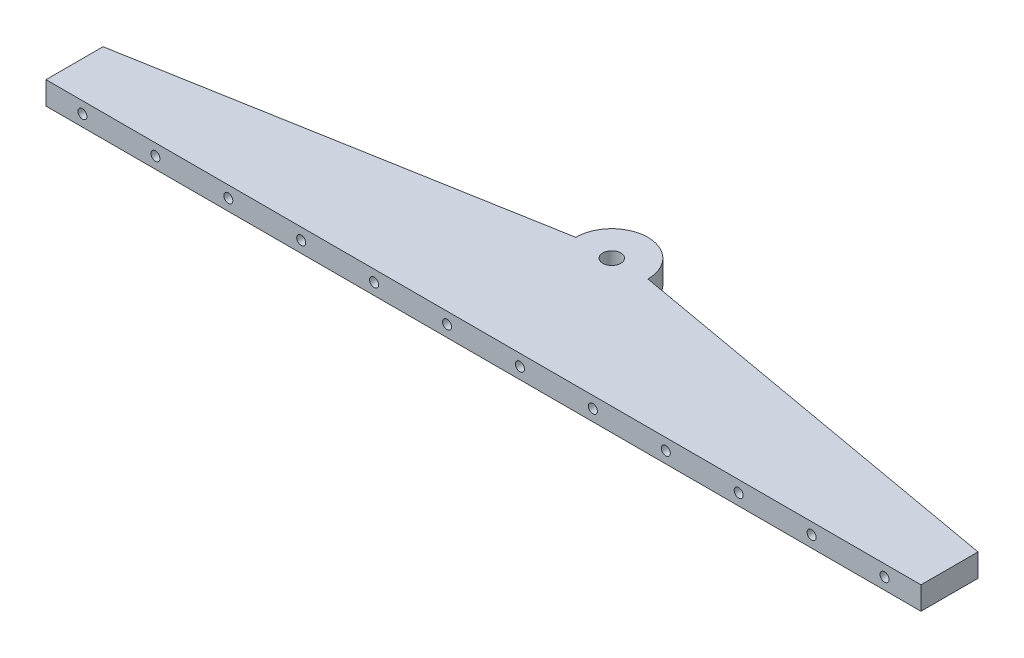
ISO-10303-21;
HEADER;
FILE_DESCRIPTION(('STEP AP214'),'2;1');
FILE_NAME('part.step','',(''),(''),'','','');
FILE_SCHEMA(('AUTOMOTIVE_DESIGN { 1 0 10303 214 1 1 1 1 }'));
ENDSEC;
DATA;
#1=APPLICATION_CONTEXT('core data for automotive mechanical design processes');
#2=APPLICATION_PROTOCOL_DEFINITION('international standard','automotive_design',2000,#1);
#3=PRODUCT_CONTEXT('',#1,'mechanical');
#4=PRODUCT('Part','Part','',(#3));
#5=PRODUCT_RELATED_PRODUCT_CATEGORY('part','',(#4));
#6=PRODUCT_DEFINITION_FORMATION('','',#4);
#7=PRODUCT_DEFINITION_CONTEXT('part definition',#1,'design');
#8=PRODUCT_DEFINITION('design','',#6,#7);
#9=PRODUCT_DEFINITION_SHAPE('','',#8);
#10=(LENGTH_UNIT() NAMED_UNIT(*) SI_UNIT(.MILLI.,.METRE.));
#11=(NAMED_UNIT(*) PLANE_ANGLE_UNIT() SI_UNIT($,.RADIAN.));
#12=(NAMED_UNIT(*) SI_UNIT($,.STERADIAN.) SOLID_ANGLE_UNIT());
#13=UNCERTAINTY_MEASURE_WITH_UNIT(LENGTH_MEASURE(1.E-05),#10,'distance_accuracy_value','');
#14=(GEOMETRIC_REPRESENTATION_CONTEXT(3) GLOBAL_UNCERTAINTY_ASSIGNED_CONTEXT((#13)) GLOBAL_UNIT_ASSIGNED_CONTEXT((#10,
#11,#12)) REPRESENTATION_CONTEXT('',''));
#15=CARTESIAN_POINT('',(0.,0.,0.));
#16=DIRECTION('',(0.,0.,1.));
#17=DIRECTION('',(1.,0.,0.));
#18=AXIS2_PLACEMENT_3D('',#15,#16,#17);
#19=CARTESIAN_POINT('',(0.,6.35,0.));
#20=DIRECTION('',(1.,0.,0.));
#21=DIRECTION('',(0.,0.,-1.));
#22=AXIS2_PLACEMENT_3D('',#19,#20,#21);
#23=PLANE('',#22);
#24=DIRECTION('',(0.,1.,0.));
#25=VECTOR('',#24,1.);
#26=CARTESIAN_POINT('',(0.,-3.65,-15.7961222393426));
#27=LINE('',#26,#25);
#28=CARTESIAN_POINT('',(0.,0.,-15.7961222393426));
#29=VERTEX_POINT('',#28);
#30=CARTESIAN_POINT('',(0.,6.35,-15.7961222393426));
#31=VERTEX_POINT('',#30);
#32=EDGE_CURVE('E126',#29,#31,#27,.T.);
#33=ORIENTED_EDGE('',*,*,#32,.F.);
#34=DIRECTION('',(0.,0.,1.));
#35=VECTOR('',#34,1.);
#36=CARTESIAN_POINT('',(0.,0.,0.));
#37=LINE('',#36,#35);
#38=CARTESIAN_POINT('',(0.,0.,0.));
#39=VERTEX_POINT('',#38);
#40=EDGE_CURVE('E85',#29,#39,#37,.T.);
#41=ORIENTED_EDGE('',*,*,#40,.T.);
#42=DIRECTION('',(0.,-1.,0.));
#43=VECTOR('',#42,1.);
#44=CARTESIAN_POINT('',(0.,6.35,0.));
#45=LINE('',#44,#43);
#46=CARTESIAN_POINT('',(0.,6.35,0.));
#47=VERTEX_POINT('',#46);
#48=EDGE_CURVE('E80',#47,#39,#45,.T.);
#49=ORIENTED_EDGE('',*,*,#48,.F.);
#50=DIRECTION('',(0.,0.,1.));
#51=VECTOR('',#50,1.);
#52=CARTESIAN_POINT('',(0.,6.35,0.));
#53=LINE('',#52,#51);
#54=EDGE_CURVE('E95',#31,#47,#53,.T.);
#55=ORIENTED_EDGE('',*,*,#54,.F.);
#56=EDGE_LOOP('',(#33,#41,#49,#55));
#57=FACE_BOUND('',#56,.T.);
#58=ADVANCED_FACE('F38',(#57),#23,.F.);
#59=CARTESIAN_POINT('',(242.4,6.35,0.));
#60=DIRECTION('',(-1.,0.,0.));
#61=DIRECTION('',(0.,0.,1.));
#62=AXIS2_PLACEMENT_3D('',#59,#60,#61);
#63=PLANE('',#62);
#64=DIRECTION('',(0.,1.,0.));
#65=VECTOR('',#64,1.);
#66=CARTESIAN_POINT('',(242.4,-3.65,-15.7961222393426));
#67=LINE('',#66,#65);
#68=CARTESIAN_POINT('',(242.4,0.,-15.7961222393426));
#69=VERTEX_POINT('',#68);
#70=CARTESIAN_POINT('',(242.4,6.35,-15.7961222393426));
#71=VERTEX_POINT('',#70);
#72=EDGE_CURVE('E52',#69,#71,#67,.T.);
#73=ORIENTED_EDGE('',*,*,#72,.T.);
#74=DIRECTION('',(0.,0.,-1.));
#75=VECTOR('',#74,1.);
#76=CARTESIAN_POINT('',(242.4,6.35,0.));
#77=LINE('',#76,#75);
#78=CARTESIAN_POINT('',(242.4,6.35,0.));
#79=VERTEX_POINT('',#78);
#80=EDGE_CURVE('E90',#79,#71,#77,.T.);
#81=ORIENTED_EDGE('',*,*,#80,.F.);
#82=DIRECTION('',(0.,-1.,0.));
#83=VECTOR('',#82,1.);
#84=CARTESIAN_POINT('',(242.4,6.35,0.));
#85=LINE('',#84,#83);
#86=CARTESIAN_POINT('',(242.4,0.,0.));
#87=VERTEX_POINT('',#86);
#88=EDGE_CURVE('E77',#79,#87,#85,.T.);
#89=ORIENTED_EDGE('',*,*,#88,.T.);
#90=DIRECTION('',(0.,0.,-1.));
#91=VECTOR('',#90,1.);
#92=CARTESIAN_POINT('',(242.4,0.,0.));
#93=LINE('',#92,#91);
#94=EDGE_CURVE('E84',#87,#69,#93,.T.);
#95=ORIENTED_EDGE('',*,*,#94,.T.);
#96=EDGE_LOOP('',(#73,#81,#89,#95));
#97=FACE_BOUND('',#96,.T.);
#98=ADVANCED_FACE('F89',(#97),#63,.F.);
#99=CARTESIAN_POINT('',(0.,6.35,0.));
#100=DIRECTION('',(0.,-1.,0.));
#101=DIRECTION('',(0.,0.,-1.));
#102=AXIS2_PLACEMENT_3D('',#99,#100,#101);
#103=PLANE('',#102);
#104=CARTESIAN_POINT('',(121.2,6.35,-35.55));
#105=DIRECTION('',(0.,1.,0.));
#106=DIRECTION('',(0.,0.,1.));
#107=AXIS2_PLACEMENT_3D('',#104,#105,#106);
#108=CIRCLE('',#107,2.49999999999999);
#109=CARTESIAN_POINT('',(121.2,6.35,-33.05));
#110=VERTEX_POINT('',#109);
#111=EDGE_CURVE('E420',#110,#110,#108,.T.);
#112=ORIENTED_EDGE('',*,*,#111,.F.);
#113=EDGE_LOOP('',(#112));
#114=FACE_BOUND('',#113,.T.);
#115=DIRECTION('',(-0.984585404129496,0.,0.174904493867819));
#116=VECTOR('',#115,1.);
#117=CARTESIAN_POINT('',(0.,6.35,-15.7961222393426));
#118=LINE('',#117,#116);
#119=CARTESIAN_POINT('',(111.2,6.35,-35.55));
#120=VERTEX_POINT('',#119);
#121=EDGE_CURVE('E124',#120,#31,#118,.T.);
#122=ORIENTED_EDGE('',*,*,#121,.T.);
#123=ORIENTED_EDGE('',*,*,#54,.T.);
#124=DIRECTION('',(1.,0.,0.));
#125=VECTOR('',#124,1.);
#126=CARTESIAN_POINT('',(0.,6.35,0.));
#127=LINE('',#126,#125);
#128=EDGE_CURVE('E61',#47,#79,#127,.T.);
#129=ORIENTED_EDGE('',*,*,#128,.T.);
#130=ORIENTED_EDGE('',*,*,#80,.T.);
#131=DIRECTION('',(-0.984585404129495,0.,-0.174904493867819));
#132=VECTOR('',#131,1.);
#133=CARTESIAN_POINT('',(131.2,6.35,-35.55));
#134=LINE('',#133,#132);
#135=CARTESIAN_POINT('',(131.2,6.35,-35.55));
#136=VERTEX_POINT('',#135);
#137=EDGE_CURVE('E262',#71,#136,#134,.T.);
#138=ORIENTED_EDGE('',*,*,#137,.T.);
#139=CARTESIAN_POINT('',(121.2,6.35,-35.55));
#140=DIRECTION('',(0.,1.,0.));
#141=DIRECTION('',(0.,0.,-1.));
#142=AXIS2_PLACEMENT_3D('',#139,#140,#141);
#143=CIRCLE('',#142,9.99999999999999);
#144=EDGE_CURVE('E265',#136,#120,#143,.T.);
#145=ORIENTED_EDGE('',*,*,#144,.T.);
#146=EDGE_LOOP('',(#122,#123,#129,#130,#138,#145));
#147=FACE_BOUND('',#146,.T.);
#148=ADVANCED_FACE('F266',(#114,#147),#103,.F.);
#149=CARTESIAN_POINT('',(0.,0.,0.));
#150=DIRECTION('',(0.,-1.,0.));
#151=DIRECTION('',(0.,0.,-1.));
#152=AXIS2_PLACEMENT_3D('',#149,#150,#151);
#153=PLANE('',#152);
#154=CARTESIAN_POINT('',(121.2,0.,-35.55));
#155=DIRECTION('',(0.,1.,0.));
#156=DIRECTION('',(0.,0.,1.));
#157=AXIS2_PLACEMENT_3D('',#154,#155,#156);
#158=CIRCLE('',#157,2.5);
#159=CARTESIAN_POINT('',(121.2,0.,-33.05));
#160=VERTEX_POINT('',#159);
#161=EDGE_CURVE('E196',#160,#160,#158,.T.);
#162=ORIENTED_EDGE('',*,*,#161,.T.);
#163=EDGE_LOOP('',(#162));
#164=FACE_BOUND('',#163,.T.);
#165=ORIENTED_EDGE('',*,*,#40,.F.);
#166=DIRECTION('',(0.984585404129495,0.,-0.174904493867819));
#167=VECTOR('',#166,1.);
#168=CARTESIAN_POINT('',(-2.72022512310274,0.,-15.3128938709682));
#169=LINE('',#168,#167);
#170=CARTESIAN_POINT('',(111.2,0.,-35.55));
#171=VERTEX_POINT('',#170);
#172=EDGE_CURVE('E12',#29,#171,#169,.T.);
#173=ORIENTED_EDGE('',*,*,#172,.T.);
#174=CARTESIAN_POINT('',(121.2,0.,-35.55));
#175=DIRECTION('',(0.,-1.,0.));
#176=DIRECTION('',(0.,0.,-1.));
#177=AXIS2_PLACEMENT_3D('',#174,#175,#176);
#178=CIRCLE('',#177,9.99999999999999);
#179=CARTESIAN_POINT('',(131.2,0.,-35.55));
#180=VERTEX_POINT('',#179);
#181=EDGE_CURVE('E45',#171,#180,#178,.T.);
#182=ORIENTED_EDGE('',*,*,#181,.T.);
#183=DIRECTION('',(0.984585404129496,0.,0.174904493867819));
#184=VECTOR('',#183,1.);
#185=CARTESIAN_POINT('',(10.135624593881,0.,-57.0562128861763));
#186=LINE('',#185,#184);
#187=EDGE_CURVE('E94',#180,#69,#186,.T.);
#188=ORIENTED_EDGE('',*,*,#187,.T.);
#189=ORIENTED_EDGE('',*,*,#94,.F.);
#190=DIRECTION('',(1.,0.,0.));
#191=VECTOR('',#190,1.);
#192=CARTESIAN_POINT('',(0.,0.,0.));
#193=LINE('',#192,#191);
#194=EDGE_CURVE('E74',#39,#87,#193,.T.);
#195=ORIENTED_EDGE('',*,*,#194,.F.);
#196=EDGE_LOOP('',(#165,#173,#182,#188,#189,#195));
#197=FACE_BOUND('',#196,.T.);
#198=ADVANCED_FACE('F92',(#164,#197),#153,.T.);
#199=CARTESIAN_POINT('',(0.,6.35,0.));
#200=DIRECTION('',(0.,0.,-1.));
#201=DIRECTION('',(-1.,0.,0.));
#202=AXIS2_PLACEMENT_3D('',#199,#200,#201);
#203=PLANE('',#202);
#204=CARTESIAN_POINT('',(10.1,3.175,0.));
#205=DIRECTION('',(0.,0.,1.));
#206=DIRECTION('',(1.,0.,0.));
#207=AXIS2_PLACEMENT_3D('',#204,#205,#206);
#208=CIRCLE('',#207,1.24999999999999);
#209=CARTESIAN_POINT('',(11.35,3.175,0.));
#210=VERTEX_POINT('',#209);
#211=EDGE_CURVE('E190',#210,#210,#208,.T.);
#212=ORIENTED_EDGE('',*,*,#211,.F.);
#213=EDGE_LOOP('',(#212));
#214=FACE_BOUND('',#213,.T.);
#215=CARTESIAN_POINT('',(30.3,3.175,0.));
#216=DIRECTION('',(0.,0.,1.));
#217=DIRECTION('',(1.,0.,0.));
#218=AXIS2_PLACEMENT_3D('',#215,#216,#217);
#219=CIRCLE('',#218,1.24999999999999);
#220=CARTESIAN_POINT('',(31.55,3.175,0.));
#221=VERTEX_POINT('',#220);
#222=EDGE_CURVE('E189',#221,#221,#219,.T.);
#223=ORIENTED_EDGE('',*,*,#222,.F.);
#224=EDGE_LOOP('',(#223));
#225=FACE_BOUND('',#224,.T.);
#226=CARTESIAN_POINT('',(50.5,3.175,0.));
#227=DIRECTION('',(0.,0.,1.));
#228=DIRECTION('',(1.,0.,0.));
#229=AXIS2_PLACEMENT_3D('',#226,#227,#228);
#230=CIRCLE('',#229,1.24999999999999);
#231=CARTESIAN_POINT('',(51.75,3.175,0.));
#232=VERTEX_POINT('',#231);
#233=EDGE_CURVE('E202',#232,#232,#230,.T.);
#234=ORIENTED_EDGE('',*,*,#233,.F.);
#235=EDGE_LOOP('',(#234));
#236=FACE_BOUND('',#235,.T.);
#237=CARTESIAN_POINT('',(70.7,3.175,0.));
#238=DIRECTION('',(0.,0.,1.));
#239=DIRECTION('',(1.,0.,0.));
#240=AXIS2_PLACEMENT_3D('',#237,#238,#239);
#241=CIRCLE('',#240,1.24999999999999);
#242=CARTESIAN_POINT('',(71.95,3.175,0.));
#243=VERTEX_POINT('',#242);
#244=EDGE_CURVE('E208',#243,#243,#241,.T.);
#245=ORIENTED_EDGE('',*,*,#244,.F.);
#246=EDGE_LOOP('',(#245));
#247=FACE_BOUND('',#246,.T.);
#248=CARTESIAN_POINT('',(90.9,3.175,0.));
#249=DIRECTION('',(0.,0.,1.));
#250=DIRECTION('',(1.,0.,0.));
#251=AXIS2_PLACEMENT_3D('',#248,#249,#250);
#252=CIRCLE('',#251,1.24999999999999);
#253=CARTESIAN_POINT('',(92.15,3.175,0.));
#254=VERTEX_POINT('',#253);
#255=EDGE_CURVE('E214',#254,#254,#252,.T.);
#256=ORIENTED_EDGE('',*,*,#255,.F.);
#257=EDGE_LOOP('',(#256));
#258=FACE_BOUND('',#257,.T.);
#259=CARTESIAN_POINT('',(111.1,3.175,0.));
#260=DIRECTION('',(0.,0.,1.));
#261=DIRECTION('',(1.,0.,0.));
#262=AXIS2_PLACEMENT_3D('',#259,#260,#261);
#263=CIRCLE('',#262,1.24999999999999);
#264=CARTESIAN_POINT('',(112.35,3.175,0.));
#265=VERTEX_POINT('',#264);
#266=EDGE_CURVE('E220',#265,#265,#263,.T.);
#267=ORIENTED_EDGE('',*,*,#266,.F.);
#268=EDGE_LOOP('',(#267));
#269=FACE_BOUND('',#268,.T.);
#270=CARTESIAN_POINT('',(131.3,3.175,0.));
#271=DIRECTION('',(0.,0.,1.));
#272=DIRECTION('',(1.,0.,0.));
#273=AXIS2_PLACEMENT_3D('',#270,#271,#272);
#274=CIRCLE('',#273,1.25);
#275=CARTESIAN_POINT('',(132.55,3.175,0.));
#276=VERTEX_POINT('',#275);
#277=EDGE_CURVE('E226',#276,#276,#274,.T.);
#278=ORIENTED_EDGE('',*,*,#277,.F.);
#279=EDGE_LOOP('',(#278));
#280=FACE_BOUND('',#279,.T.);
#281=CARTESIAN_POINT('',(151.5,3.175,0.));
#282=DIRECTION('',(0.,0.,1.));
#283=DIRECTION('',(1.,0.,0.));
#284=AXIS2_PLACEMENT_3D('',#281,#282,#283);
#285=CIRCLE('',#284,1.25);
#286=CARTESIAN_POINT('',(152.75,3.175,0.));
#287=VERTEX_POINT('',#286);
#288=EDGE_CURVE('E232',#287,#287,#285,.T.);
#289=ORIENTED_EDGE('',*,*,#288,.F.);
#290=EDGE_LOOP('',(#289));
#291=FACE_BOUND('',#290,.T.);
#292=CARTESIAN_POINT('',(171.7,3.175,0.));
#293=DIRECTION('',(0.,0.,1.));
#294=DIRECTION('',(1.,0.,0.));
#295=AXIS2_PLACEMENT_3D('',#292,#293,#294);
#296=CIRCLE('',#295,1.25);
#297=CARTESIAN_POINT('',(172.95,3.175,0.));
#298=VERTEX_POINT('',#297);
#299=EDGE_CURVE('E238',#298,#298,#296,.T.);
#300=ORIENTED_EDGE('',*,*,#299,.F.);
#301=EDGE_LOOP('',(#300));
#302=FACE_BOUND('',#301,.T.);
#303=CARTESIAN_POINT('',(191.9,3.175,0.));
#304=DIRECTION('',(0.,0.,1.));
#305=DIRECTION('',(1.,0.,0.));
#306=AXIS2_PLACEMENT_3D('',#303,#304,#305);
#307=CIRCLE('',#306,1.25);
#308=CARTESIAN_POINT('',(193.15,3.175,0.));
#309=VERTEX_POINT('',#308);
#310=EDGE_CURVE('E244',#309,#309,#307,.T.);
#311=ORIENTED_EDGE('',*,*,#310,.F.);
#312=EDGE_LOOP('',(#311));
#313=FACE_BOUND('',#312,.T.);
#314=CARTESIAN_POINT('',(212.1,3.175,0.));
#315=DIRECTION('',(0.,0.,1.));
#316=DIRECTION('',(1.,0.,0.));
#317=AXIS2_PLACEMENT_3D('',#314,#315,#316);
#318=CIRCLE('',#317,1.25);
#319=CARTESIAN_POINT('',(213.35,3.175,0.));
#320=VERTEX_POINT('',#319);
#321=EDGE_CURVE('E250',#320,#320,#318,.T.);
#322=ORIENTED_EDGE('',*,*,#321,.F.);
#323=EDGE_LOOP('',(#322));
#324=FACE_BOUND('',#323,.T.);
#325=CARTESIAN_POINT('',(232.3,3.175,0.));
#326=DIRECTION('',(0.,0.,1.));
#327=DIRECTION('',(1.,0.,0.));
#328=AXIS2_PLACEMENT_3D('',#325,#326,#327);
#329=CIRCLE('',#328,1.25);
#330=CARTESIAN_POINT('',(233.55,3.175,0.));
#331=VERTEX_POINT('',#330);
#332=EDGE_CURVE('E256',#331,#331,#329,.T.);
#333=ORIENTED_EDGE('',*,*,#332,.F.);
#334=EDGE_LOOP('',(#333));
#335=FACE_BOUND('',#334,.T.);
#336=ORIENTED_EDGE('',*,*,#194,.T.);
#337=ORIENTED_EDGE('',*,*,#88,.F.);
#338=ORIENTED_EDGE('',*,*,#128,.F.);
#339=ORIENTED_EDGE('',*,*,#48,.T.);
#340=EDGE_LOOP('',(#336,#337,#338,#339));
#341=FACE_BOUND('',#340,.T.);
#342=ADVANCED_FACE('F76',(#214,#225,#236,#247,#258,#269,#280,#291,#302,#313,#324,#335,#341),
#203,.F.);
#343=CARTESIAN_POINT('',(0.,-3.65,-15.7961222393426));
#344=DIRECTION('',(-0.174904493867819,0.,-0.984585404129496));
#345=DIRECTION('',(-0.984585404129495,0.,0.174904493867819));
#346=AXIS2_PLACEMENT_3D('',#343,#344,#345);
#347=PLANE('',#346);
#348=ORIENTED_EDGE('',*,*,#32,.T.);
#349=ORIENTED_EDGE('',*,*,#121,.F.);
#350=DIRECTION('',(0.,1.,0.));
#351=VECTOR('',#350,1.);
#352=CARTESIAN_POINT('',(111.2,-3.65,-35.55));
#353=LINE('',#352,#351);
#354=EDGE_CURVE('E114',#171,#120,#353,.T.);
#355=ORIENTED_EDGE('',*,*,#354,.F.);
#356=ORIENTED_EDGE('',*,*,#172,.F.);
#357=EDGE_LOOP('',(#348,#349,#355,#356));
#358=FACE_BOUND('',#357,.T.);
#359=ADVANCED_FACE('F121',(#358),#347,.T.);
#360=CARTESIAN_POINT('',(121.2,-3.65,-35.55));
#361=DIRECTION('',(0.,1.,0.));
#362=DIRECTION('',(0.,0.,1.));
#363=AXIS2_PLACEMENT_3D('',#360,#361,#362);
#364=CYLINDRICAL_SURFACE('',#363,9.99999999999999);
#365=ORIENTED_EDGE('',*,*,#354,.T.);
#366=ORIENTED_EDGE('',*,*,#144,.F.);
#367=DIRECTION('',(0.,1.,0.));
#368=VECTOR('',#367,1.);
#369=CARTESIAN_POINT('',(131.2,-3.65,-35.55));
#370=LINE('',#369,#368);
#371=EDGE_CURVE('E117',#180,#136,#370,.T.);
#372=ORIENTED_EDGE('',*,*,#371,.F.);
#373=ORIENTED_EDGE('',*,*,#181,.F.);
#374=EDGE_LOOP('',(#365,#366,#372,#373));
#375=FACE_BOUND('',#374,.T.);
#376=ADVANCED_FACE('F111',(#375),#364,.T.);
#377=CARTESIAN_POINT('',(131.2,-3.65,-35.55));
#378=DIRECTION('',(0.174904493867819,0.,-0.984585404129495));
#379=DIRECTION('',(-0.984585404129496,0.,-0.174904493867819));
#380=AXIS2_PLACEMENT_3D('',#377,#378,#379);
#381=PLANE('',#380);
#382=ORIENTED_EDGE('',*,*,#371,.T.);
#383=ORIENTED_EDGE('',*,*,#137,.F.);
#384=ORIENTED_EDGE('',*,*,#72,.F.);
#385=ORIENTED_EDGE('',*,*,#187,.F.);
#386=EDGE_LOOP('',(#382,#383,#384,#385));
#387=FACE_BOUND('',#386,.T.);
#388=ADVANCED_FACE('F267',(#387),#381,.T.);
#389=CARTESIAN_POINT('',(232.3,3.175,-6.00000000000001));
#390=DIRECTION('',(0.,0.,1.));
#391=DIRECTION('',(1.,0.,0.));
#392=AXIS2_PLACEMENT_3D('',#389,#390,#391);
#393=CONICAL_SURFACE('',#392,1.25,1.02974425867666);
#394=CARTESIAN_POINT('',(232.3,3.175,-6.75107577378445));
#395=VERTEX_POINT('',#394);
#396=VERTEX_LOOP('',#395);
#397=FACE_BOUND('',#396,.T.);
#398=CARTESIAN_POINT('',(232.3,3.175,-6.00000000000001));
#399=DIRECTION('',(0.,0.,1.));
#400=DIRECTION('',(1.,0.,0.));
#401=AXIS2_PLACEMENT_3D('',#398,#399,#400);
#402=CIRCLE('',#401,1.25);
#403=CARTESIAN_POINT('',(233.55,3.175,-6.00000000000001));
#404=VERTEX_POINT('',#403);
#405=EDGE_CURVE('E259',#404,#404,#402,.T.);
#406=ORIENTED_EDGE('',*,*,#405,.T.);
#407=EDGE_LOOP('',(#406));
#408=FACE_BOUND('',#407,.T.);
#409=ADVANCED_FACE('F269',(#397,#408),#393,.F.);
#410=CARTESIAN_POINT('',(232.3,3.175,0.));
#411=DIRECTION('',(0.,0.,1.));
#412=DIRECTION('',(1.,0.,0.));
#413=AXIS2_PLACEMENT_3D('',#410,#411,#412);
#414=CYLINDRICAL_SURFACE('',#413,1.25);
#415=ORIENTED_EDGE('',*,*,#405,.F.);
#416=EDGE_LOOP('',(#415));
#417=FACE_BOUND('',#416,.T.);
#418=ORIENTED_EDGE('',*,*,#332,.T.);
#419=EDGE_LOOP('',(#418));
#420=FACE_BOUND('',#419,.T.);
#421=ADVANCED_FACE('F275',(#417,#420),#414,.F.);
#422=CARTESIAN_POINT('',(212.1,3.175,-6.00000000000001));
#423=DIRECTION('',(0.,0.,1.));
#424=DIRECTION('',(1.,0.,0.));
#425=AXIS2_PLACEMENT_3D('',#422,#423,#424);
#426=CONICAL_SURFACE('',#425,1.25,1.02974425867666);
#427=CARTESIAN_POINT('',(212.1,3.175,-6.75107577378445));
#428=VERTEX_POINT('',#427);
#429=VERTEX_LOOP('',#428);
#430=FACE_BOUND('',#429,.T.);
#431=CARTESIAN_POINT('',(212.1,3.175,-6.00000000000001));
#432=DIRECTION('',(0.,0.,1.));
#433=DIRECTION('',(1.,0.,0.));
#434=AXIS2_PLACEMENT_3D('',#431,#432,#433);
#435=CIRCLE('',#434,1.25);
#436=CARTESIAN_POINT('',(213.35,3.175,-6.00000000000001));
#437=VERTEX_POINT('',#436);
#438=EDGE_CURVE('E253',#437,#437,#435,.T.);
#439=ORIENTED_EDGE('',*,*,#438,.T.);
#440=EDGE_LOOP('',(#439));
#441=FACE_BOUND('',#440,.T.);
#442=ADVANCED_FACE('F323',(#430,#441),#426,.F.);
#443=CARTESIAN_POINT('',(212.1,3.175,0.));
#444=DIRECTION('',(0.,0.,1.));
#445=DIRECTION('',(1.,0.,0.));
#446=AXIS2_PLACEMENT_3D('',#443,#444,#445);
#447=CYLINDRICAL_SURFACE('',#446,1.25);
#448=ORIENTED_EDGE('',*,*,#438,.F.);
#449=EDGE_LOOP('',(#448));
#450=FACE_BOUND('',#449,.T.);
#451=ORIENTED_EDGE('',*,*,#321,.T.);
#452=EDGE_LOOP('',(#451));
#453=FACE_BOUND('',#452,.T.);
#454=ADVANCED_FACE('F329',(#450,#453),#447,.F.);
#455=CARTESIAN_POINT('',(191.9,3.175,-6.00000000000001));
#456=DIRECTION('',(0.,0.,1.));
#457=DIRECTION('',(1.,0.,0.));
#458=AXIS2_PLACEMENT_3D('',#455,#456,#457);
#459=CONICAL_SURFACE('',#458,1.25,1.02974425867666);
#460=CARTESIAN_POINT('',(191.9,3.175,-6.75107577378445));
#461=VERTEX_POINT('',#460);
#462=VERTEX_LOOP('',#461);
#463=FACE_BOUND('',#462,.T.);
#464=CARTESIAN_POINT('',(191.9,3.175,-6.00000000000001));
#465=DIRECTION('',(0.,0.,1.));
#466=DIRECTION('',(1.,0.,0.));
#467=AXIS2_PLACEMENT_3D('',#464,#465,#466);
#468=CIRCLE('',#467,1.25);
#469=CARTESIAN_POINT('',(193.15,3.175,-6.00000000000001));
#470=VERTEX_POINT('',#469);
#471=EDGE_CURVE('E247',#470,#470,#468,.T.);
#472=ORIENTED_EDGE('',*,*,#471,.T.);
#473=EDGE_LOOP('',(#472));
#474=FACE_BOUND('',#473,.T.);
#475=ADVANCED_FACE('F336',(#463,#474),#459,.F.);
#476=CARTESIAN_POINT('',(191.9,3.175,0.));
#477=DIRECTION('',(0.,0.,1.));
#478=DIRECTION('',(1.,0.,0.));
#479=AXIS2_PLACEMENT_3D('',#476,#477,#478);
#480=CYLINDRICAL_SURFACE('',#479,1.25);
#481=ORIENTED_EDGE('',*,*,#471,.F.);
#482=EDGE_LOOP('',(#481));
#483=FACE_BOUND('',#482,.T.);
#484=ORIENTED_EDGE('',*,*,#310,.T.);
#485=EDGE_LOOP('',(#484));
#486=FACE_BOUND('',#485,.T.);
#487=ADVANCED_FACE('F340',(#483,#486),#480,.F.);
#488=CARTESIAN_POINT('',(171.7,3.175,-6.00000000000001));
#489=DIRECTION('',(0.,0.,1.));
#490=DIRECTION('',(1.,0.,0.));
#491=AXIS2_PLACEMENT_3D('',#488,#489,#490);
#492=CONICAL_SURFACE('',#491,1.25,1.02974425867666);
#493=CARTESIAN_POINT('',(171.7,3.175,-6.75107577378445));
#494=VERTEX_POINT('',#493);
#495=VERTEX_LOOP('',#494);
#496=FACE_BOUND('',#495,.T.);
#497=CARTESIAN_POINT('',(171.7,3.175,-6.00000000000001));
#498=DIRECTION('',(0.,0.,1.));
#499=DIRECTION('',(1.,0.,0.));
#500=AXIS2_PLACEMENT_3D('',#497,#498,#499);
#501=CIRCLE('',#500,1.25);
#502=CARTESIAN_POINT('',(172.95,3.175,-6.00000000000001));
#503=VERTEX_POINT('',#502);
#504=EDGE_CURVE('E241',#503,#503,#501,.T.);
#505=ORIENTED_EDGE('',*,*,#504,.T.);
#506=EDGE_LOOP('',(#505));
#507=FACE_BOUND('',#506,.T.);
#508=ADVANCED_FACE('F344',(#496,#507),#492,.F.);
#509=CARTESIAN_POINT('',(171.7,3.175,0.));
#510=DIRECTION('',(0.,0.,1.));
#511=DIRECTION('',(1.,0.,0.));
#512=AXIS2_PLACEMENT_3D('',#509,#510,#511);
#513=CYLINDRICAL_SURFACE('',#512,1.25);
#514=ORIENTED_EDGE('',*,*,#504,.F.);
#515=EDGE_LOOP('',(#514));
#516=FACE_BOUND('',#515,.T.);
#517=ORIENTED_EDGE('',*,*,#299,.T.);
#518=EDGE_LOOP('',(#517));
#519=FACE_BOUND('',#518,.T.);
#520=ADVANCED_FACE('F348',(#516,#519),#513,.F.);
#521=CARTESIAN_POINT('',(151.5,3.175,-6.00000000000001));
#522=DIRECTION('',(0.,0.,1.));
#523=DIRECTION('',(1.,0.,0.));
#524=AXIS2_PLACEMENT_3D('',#521,#522,#523);
#525=CONICAL_SURFACE('',#524,1.25,1.02974425867666);
#526=CARTESIAN_POINT('',(151.5,3.175,-6.75107577378445));
#527=VERTEX_POINT('',#526);
#528=VERTEX_LOOP('',#527);
#529=FACE_BOUND('',#528,.T.);
#530=CARTESIAN_POINT('',(151.5,3.175,-6.00000000000001));
#531=DIRECTION('',(0.,0.,1.));
#532=DIRECTION('',(1.,0.,0.));
#533=AXIS2_PLACEMENT_3D('',#530,#531,#532);
#534=CIRCLE('',#533,1.25);
#535=CARTESIAN_POINT('',(152.75,3.175,-6.00000000000001));
#536=VERTEX_POINT('',#535);
#537=EDGE_CURVE('E235',#536,#536,#534,.T.);
#538=ORIENTED_EDGE('',*,*,#537,.T.);
#539=EDGE_LOOP('',(#538));
#540=FACE_BOUND('',#539,.T.);
#541=ADVANCED_FACE('F352',(#529,#540),#525,.F.);
#542=CARTESIAN_POINT('',(151.5,3.175,0.));
#543=DIRECTION('',(0.,0.,1.));
#544=DIRECTION('',(1.,0.,0.));
#545=AXIS2_PLACEMENT_3D('',#542,#543,#544);
#546=CYLINDRICAL_SURFACE('',#545,1.25);
#547=ORIENTED_EDGE('',*,*,#537,.F.);
#548=EDGE_LOOP('',(#547));
#549=FACE_BOUND('',#548,.T.);
#550=ORIENTED_EDGE('',*,*,#288,.T.);
#551=EDGE_LOOP('',(#550));
#552=FACE_BOUND('',#551,.T.);
#553=ADVANCED_FACE('F356',(#549,#552),#546,.F.);
#554=CARTESIAN_POINT('',(131.3,3.175,-6.00000000000001));
#555=DIRECTION('',(0.,0.,1.));
#556=DIRECTION('',(1.,0.,0.));
#557=AXIS2_PLACEMENT_3D('',#554,#555,#556);
#558=CONICAL_SURFACE('',#557,1.25,1.02974425867666);
#559=CARTESIAN_POINT('',(131.3,3.175,-6.75107577378445));
#560=VERTEX_POINT('',#559);
#561=VERTEX_LOOP('',#560);
#562=FACE_BOUND('',#561,.T.);
#563=CARTESIAN_POINT('',(131.3,3.175,-6.00000000000001));
#564=DIRECTION('',(0.,0.,1.));
#565=DIRECTION('',(1.,0.,0.));
#566=AXIS2_PLACEMENT_3D('',#563,#564,#565);
#567=CIRCLE('',#566,1.25);
#568=CARTESIAN_POINT('',(132.55,3.175,-6.00000000000001));
#569=VERTEX_POINT('',#568);
#570=EDGE_CURVE('E229',#569,#569,#567,.T.);
#571=ORIENTED_EDGE('',*,*,#570,.T.);
#572=EDGE_LOOP('',(#571));
#573=FACE_BOUND('',#572,.T.);
#574=ADVANCED_FACE('F360',(#562,#573),#558,.F.);
#575=CARTESIAN_POINT('',(131.3,3.175,0.));
#576=DIRECTION('',(0.,0.,1.));
#577=DIRECTION('',(1.,0.,0.));
#578=AXIS2_PLACEMENT_3D('',#575,#576,#577);
#579=CYLINDRICAL_SURFACE('',#578,1.25);
#580=ORIENTED_EDGE('',*,*,#570,.F.);
#581=EDGE_LOOP('',(#580));
#582=FACE_BOUND('',#581,.T.);
#583=ORIENTED_EDGE('',*,*,#277,.T.);
#584=EDGE_LOOP('',(#583));
#585=FACE_BOUND('',#584,.T.);
#586=ADVANCED_FACE('F364',(#582,#585),#579,.F.);
#587=CARTESIAN_POINT('',(111.1,3.175,-6.00000000000001));
#588=DIRECTION('',(0.,0.,1.));
#589=DIRECTION('',(1.,0.,0.));
#590=AXIS2_PLACEMENT_3D('',#587,#588,#589);
#591=CONICAL_SURFACE('',#590,1.24999999999999,1.02974425867665);
#592=CARTESIAN_POINT('',(111.1,3.175,-6.75107577378445));
#593=VERTEX_POINT('',#592);
#594=VERTEX_LOOP('',#593);
#595=FACE_BOUND('',#594,.T.);
#596=CARTESIAN_POINT('',(111.1,3.175,-6.00000000000001));
#597=DIRECTION('',(0.,0.,1.));
#598=DIRECTION('',(1.,0.,0.));
#599=AXIS2_PLACEMENT_3D('',#596,#597,#598);
#600=CIRCLE('',#599,1.24999999999999);
#601=CARTESIAN_POINT('',(112.35,3.175,-6.00000000000001));
#602=VERTEX_POINT('',#601);
#603=EDGE_CURVE('E223',#602,#602,#600,.T.);
#604=ORIENTED_EDGE('',*,*,#603,.T.);
#605=EDGE_LOOP('',(#604));
#606=FACE_BOUND('',#605,.T.);
#607=ADVANCED_FACE('F368',(#595,#606),#591,.F.);
#608=CARTESIAN_POINT('',(111.1,3.175,0.));
#609=DIRECTION('',(0.,0.,1.));
#610=DIRECTION('',(1.,0.,0.));
#611=AXIS2_PLACEMENT_3D('',#608,#609,#610);
#612=CYLINDRICAL_SURFACE('',#611,1.24999999999999);
#613=ORIENTED_EDGE('',*,*,#603,.F.);
#614=EDGE_LOOP('',(#613));
#615=FACE_BOUND('',#614,.T.);
#616=ORIENTED_EDGE('',*,*,#266,.T.);
#617=EDGE_LOOP('',(#616));
#618=FACE_BOUND('',#617,.T.);
#619=ADVANCED_FACE('F372',(#615,#618),#612,.F.);
#620=CARTESIAN_POINT('',(90.9,3.175,-6.00000000000001));
#621=DIRECTION('',(0.,0.,1.));
#622=DIRECTION('',(1.,0.,0.));
#623=AXIS2_PLACEMENT_3D('',#620,#621,#622);
#624=CONICAL_SURFACE('',#623,1.24999999999999,1.02974425867665);
#625=CARTESIAN_POINT('',(90.9,3.175,-6.75107577378445));
#626=VERTEX_POINT('',#625);
#627=VERTEX_LOOP('',#626);
#628=FACE_BOUND('',#627,.T.);
#629=CARTESIAN_POINT('',(90.9,3.175,-6.00000000000001));
#630=DIRECTION('',(0.,0.,1.));
#631=DIRECTION('',(1.,0.,0.));
#632=AXIS2_PLACEMENT_3D('',#629,#630,#631);
#633=CIRCLE('',#632,1.24999999999999);
#634=CARTESIAN_POINT('',(92.15,3.175,-6.00000000000001));
#635=VERTEX_POINT('',#634);
#636=EDGE_CURVE('E217',#635,#635,#633,.T.);
#637=ORIENTED_EDGE('',*,*,#636,.T.);
#638=EDGE_LOOP('',(#637));
#639=FACE_BOUND('',#638,.T.);
#640=ADVANCED_FACE('F376',(#628,#639),#624,.F.);
#641=CARTESIAN_POINT('',(90.9,3.175,0.));
#642=DIRECTION('',(0.,0.,1.));
#643=DIRECTION('',(1.,0.,0.));
#644=AXIS2_PLACEMENT_3D('',#641,#642,#643);
#645=CYLINDRICAL_SURFACE('',#644,1.24999999999999);
#646=ORIENTED_EDGE('',*,*,#636,.F.);
#647=EDGE_LOOP('',(#646));
#648=FACE_BOUND('',#647,.T.);
#649=ORIENTED_EDGE('',*,*,#255,.T.);
#650=EDGE_LOOP('',(#649));
#651=FACE_BOUND('',#650,.T.);
#652=ADVANCED_FACE('F380',(#648,#651),#645,.F.);
#653=CARTESIAN_POINT('',(70.7,3.175,-6.00000000000001));
#654=DIRECTION('',(0.,0.,1.));
#655=DIRECTION('',(1.,0.,0.));
#656=AXIS2_PLACEMENT_3D('',#653,#654,#655);
#657=CONICAL_SURFACE('',#656,1.24999999999999,1.02974425867665);
#658=CARTESIAN_POINT('',(70.7,3.175,-6.75107577378445));
#659=VERTEX_POINT('',#658);
#660=VERTEX_LOOP('',#659);
#661=FACE_BOUND('',#660,.T.);
#662=CARTESIAN_POINT('',(70.7,3.175,-6.00000000000001));
#663=DIRECTION('',(0.,0.,1.));
#664=DIRECTION('',(1.,0.,0.));
#665=AXIS2_PLACEMENT_3D('',#662,#663,#664);
#666=CIRCLE('',#665,1.24999999999999);
#667=CARTESIAN_POINT('',(71.95,3.175,-6.00000000000001));
#668=VERTEX_POINT('',#667);
#669=EDGE_CURVE('E211',#668,#668,#666,.T.);
#670=ORIENTED_EDGE('',*,*,#669,.T.);
#671=EDGE_LOOP('',(#670));
#672=FACE_BOUND('',#671,.T.);
#673=ADVANCED_FACE('F384',(#661,#672),#657,.F.);
#674=CARTESIAN_POINT('',(70.7,3.175,0.));
#675=DIRECTION('',(0.,0.,1.));
#676=DIRECTION('',(1.,0.,0.));
#677=AXIS2_PLACEMENT_3D('',#674,#675,#676);
#678=CYLINDRICAL_SURFACE('',#677,1.24999999999999);
#679=ORIENTED_EDGE('',*,*,#669,.F.);
#680=EDGE_LOOP('',(#679));
#681=FACE_BOUND('',#680,.T.);
#682=ORIENTED_EDGE('',*,*,#244,.T.);
#683=EDGE_LOOP('',(#682));
#684=FACE_BOUND('',#683,.T.);
#685=ADVANCED_FACE('F388',(#681,#684),#678,.F.);
#686=CARTESIAN_POINT('',(50.5,3.175,-6.00000000000001));
#687=DIRECTION('',(0.,0.,1.));
#688=DIRECTION('',(1.,0.,0.));
#689=AXIS2_PLACEMENT_3D('',#686,#687,#688);
#690=CONICAL_SURFACE('',#689,1.24999999999999,1.02974425867665);
#691=CARTESIAN_POINT('',(50.5,3.175,-6.75107577378445));
#692=VERTEX_POINT('',#691);
#693=VERTEX_LOOP('',#692);
#694=FACE_BOUND('',#693,.T.);
#695=CARTESIAN_POINT('',(50.5,3.175,-6.00000000000001));
#696=DIRECTION('',(0.,0.,1.));
#697=DIRECTION('',(1.,0.,0.));
#698=AXIS2_PLACEMENT_3D('',#695,#696,#697);
#699=CIRCLE('',#698,1.24999999999999);
#700=CARTESIAN_POINT('',(51.75,3.175,-6.00000000000001));
#701=VERTEX_POINT('',#700);
#702=EDGE_CURVE('E205',#701,#701,#699,.T.);
#703=ORIENTED_EDGE('',*,*,#702,.T.);
#704=EDGE_LOOP('',(#703));
#705=FACE_BOUND('',#704,.T.);
#706=ADVANCED_FACE('F392',(#694,#705),#690,.F.);
#707=CARTESIAN_POINT('',(50.5,3.175,0.));
#708=DIRECTION('',(0.,0.,1.));
#709=DIRECTION('',(1.,0.,0.));
#710=AXIS2_PLACEMENT_3D('',#707,#708,#709);
#711=CYLINDRICAL_SURFACE('',#710,1.24999999999999);
#712=ORIENTED_EDGE('',*,*,#702,.F.);
#713=EDGE_LOOP('',(#712));
#714=FACE_BOUND('',#713,.T.);
#715=ORIENTED_EDGE('',*,*,#233,.T.);
#716=EDGE_LOOP('',(#715));
#717=FACE_BOUND('',#716,.T.);
#718=ADVANCED_FACE('F396',(#714,#717),#711,.F.);
#719=CARTESIAN_POINT('',(30.3,3.175,-6.00000000000001));
#720=DIRECTION('',(0.,0.,1.));
#721=DIRECTION('',(1.,0.,0.));
#722=AXIS2_PLACEMENT_3D('',#719,#720,#721);
#723=CONICAL_SURFACE('',#722,1.24999999999999,1.02974425867665);
#724=CARTESIAN_POINT('',(30.3,3.175,-6.75107577378445));
#725=VERTEX_POINT('',#724);
#726=VERTEX_LOOP('',#725);
#727=FACE_BOUND('',#726,.T.);
#728=CARTESIAN_POINT('',(30.3,3.175,-6.00000000000001));
#729=DIRECTION('',(0.,0.,1.));
#730=DIRECTION('',(1.,0.,0.));
#731=AXIS2_PLACEMENT_3D('',#728,#729,#730);
#732=CIRCLE('',#731,1.24999999999999);
#733=CARTESIAN_POINT('',(31.55,3.175,-6.00000000000001));
#734=VERTEX_POINT('',#733);
#735=EDGE_CURVE('E193',#734,#734,#732,.T.);
#736=ORIENTED_EDGE('',*,*,#735,.T.);
#737=EDGE_LOOP('',(#736));
#738=FACE_BOUND('',#737,.T.);
#739=ADVANCED_FACE('F400',(#727,#738),#723,.F.);
#740=CARTESIAN_POINT('',(30.3,3.175,0.));
#741=DIRECTION('',(0.,0.,1.));
#742=DIRECTION('',(1.,0.,0.));
#743=AXIS2_PLACEMENT_3D('',#740,#741,#742);
#744=CYLINDRICAL_SURFACE('',#743,1.24999999999999);
#745=ORIENTED_EDGE('',*,*,#735,.F.);
#746=EDGE_LOOP('',(#745));
#747=FACE_BOUND('',#746,.T.);
#748=ORIENTED_EDGE('',*,*,#222,.T.);
#749=EDGE_LOOP('',(#748));
#750=FACE_BOUND('',#749,.T.);
#751=ADVANCED_FACE('F183',(#747,#750),#744,.F.);
#752=CARTESIAN_POINT('',(10.1,3.175,-6.00000000000001));
#753=DIRECTION('',(0.,0.,1.));
#754=DIRECTION('',(1.,0.,0.));
#755=AXIS2_PLACEMENT_3D('',#752,#753,#754);
#756=CONICAL_SURFACE('',#755,1.24999999999999,1.02974425867665);
#757=CARTESIAN_POINT('',(10.1,3.175,-6.75107577378445));
#758=VERTEX_POINT('',#757);
#759=VERTEX_LOOP('',#758);
#760=FACE_BOUND('',#759,.T.);
#761=CARTESIAN_POINT('',(10.1,3.175,-6.00000000000001));
#762=DIRECTION('',(0.,0.,1.));
#763=DIRECTION('',(1.,0.,0.));
#764=AXIS2_PLACEMENT_3D('',#761,#762,#763);
#765=CIRCLE('',#764,1.24999999999999);
#766=CARTESIAN_POINT('',(11.35,3.175,-6.00000000000001));
#767=VERTEX_POINT('',#766);
#768=EDGE_CURVE('E187',#767,#767,#765,.T.);
#769=ORIENTED_EDGE('',*,*,#768,.T.);
#770=EDGE_LOOP('',(#769));
#771=FACE_BOUND('',#770,.T.);
#772=ADVANCED_FACE('F179',(#760,#771),#756,.F.);
#773=CARTESIAN_POINT('',(10.1,3.175,0.));
#774=DIRECTION('',(0.,0.,1.));
#775=DIRECTION('',(1.,0.,0.));
#776=AXIS2_PLACEMENT_3D('',#773,#774,#775);
#777=CYLINDRICAL_SURFACE('',#776,1.24999999999999);
#778=ORIENTED_EDGE('',*,*,#768,.F.);
#779=EDGE_LOOP('',(#778));
#780=FACE_BOUND('',#779,.T.);
#781=ORIENTED_EDGE('',*,*,#211,.T.);
#782=EDGE_LOOP('',(#781));
#783=FACE_BOUND('',#782,.T.);
#784=ADVANCED_FACE('F182',(#780,#783),#777,.F.);
#785=CARTESIAN_POINT('',(121.2,6.35,-35.55));
#786=DIRECTION('',(0.,1.,0.));
#787=DIRECTION('',(0.,0.,1.));
#788=AXIS2_PLACEMENT_3D('',#785,#786,#787);
#789=CYLINDRICAL_SURFACE('',#788,2.5);
#790=ORIENTED_EDGE('',*,*,#161,.F.);
#791=EDGE_LOOP('',(#790));
#792=FACE_BOUND('',#791,.T.);
#793=ORIENTED_EDGE('',*,*,#111,.T.);
#794=EDGE_LOOP('',(#793));
#795=FACE_BOUND('',#794,.T.);
#796=ADVANCED_FACE('F410',(#792,#795),#789,.F.);
#797=CLOSED_SHELL('',(#58,#98,#148,#198,#342,#359,#376,#388,#409,#421,#442,#454,#475,#487,#508,
#520,#541,#553,#574,#586,#607,#619,#640,#652,#673,#685,#706,#718,#739,#751,#772,#784,#796));
#798=MANIFOLD_SOLID_BREP('B2',#797);
#799=ADVANCED_BREP_SHAPE_REPRESENTATION('',(#18,#798),#14);
#800=SHAPE_DEFINITION_REPRESENTATION(#9,#799);
ENDSEC;
END-ISO-10303-21;
